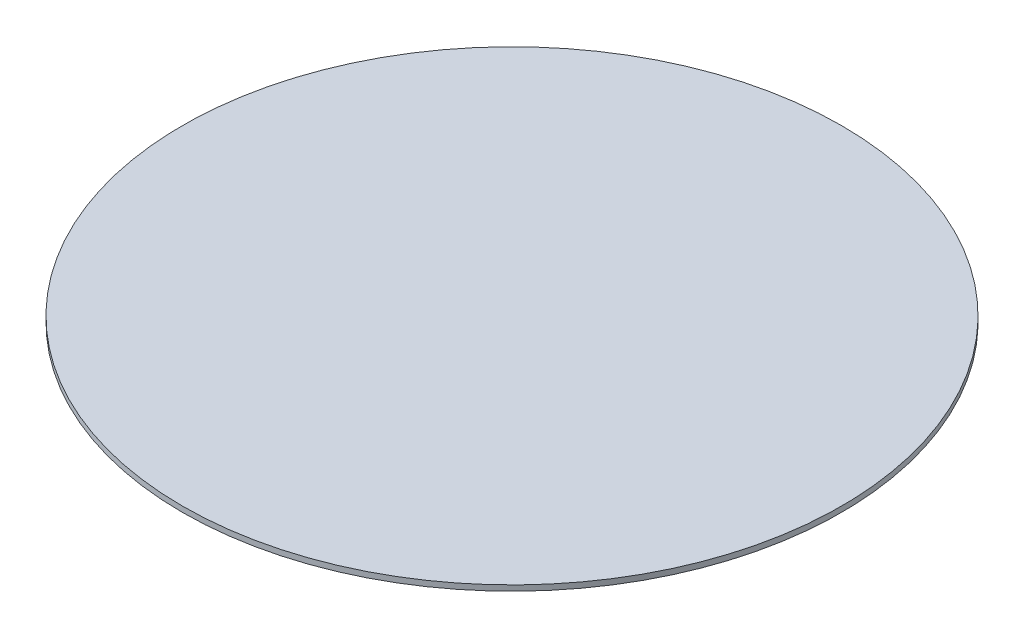
ISO-10303-21;
HEADER;
FILE_DESCRIPTION(('STEP AP214'),'2;1');
FILE_NAME('part.step','',(''),(''),'','','');
FILE_SCHEMA(('AUTOMOTIVE_DESIGN { 1 0 10303 214 1 1 1 1 }'));
ENDSEC;
DATA;
#1=APPLICATION_CONTEXT('core data for automotive mechanical design processes');
#2=APPLICATION_PROTOCOL_DEFINITION('international standard','automotive_design',2000,#1);
#3=PRODUCT_CONTEXT('',#1,'mechanical');
#4=PRODUCT('Part','Part','',(#3));
#5=PRODUCT_RELATED_PRODUCT_CATEGORY('part','',(#4));
#6=PRODUCT_DEFINITION_FORMATION('','',#4);
#7=PRODUCT_DEFINITION_CONTEXT('part definition',#1,'design');
#8=PRODUCT_DEFINITION('design','',#6,#7);
#9=PRODUCT_DEFINITION_SHAPE('','',#8);
#10=(LENGTH_UNIT() NAMED_UNIT(*) SI_UNIT(.MILLI.,.METRE.));
#11=(NAMED_UNIT(*) PLANE_ANGLE_UNIT() SI_UNIT($,.RADIAN.));
#12=(NAMED_UNIT(*) SI_UNIT($,.STERADIAN.) SOLID_ANGLE_UNIT());
#13=UNCERTAINTY_MEASURE_WITH_UNIT(LENGTH_MEASURE(1.E-05),#10,'distance_accuracy_value','');
#14=(GEOMETRIC_REPRESENTATION_CONTEXT(3) GLOBAL_UNCERTAINTY_ASSIGNED_CONTEXT((#13)) GLOBAL_UNIT_ASSIGNED_CONTEXT((#10,
#11,#12)) REPRESENTATION_CONTEXT('',''));
#15=CARTESIAN_POINT('',(0.,0.,0.));
#16=DIRECTION('',(0.,0.,1.));
#17=DIRECTION('',(1.,0.,0.));
#18=AXIS2_PLACEMENT_3D('',#15,#16,#17);
#19=CARTESIAN_POINT('',(0.,20.,0.));
#20=DIRECTION('',(0.,-1.,0.));
#21=DIRECTION('',(0.,0.,-1.));
#22=AXIS2_PLACEMENT_3D('',#19,#20,#21);
#23=CYLINDRICAL_SURFACE('',#22,1200.);
#24=CARTESIAN_POINT('',(0.,20.,0.));
#25=DIRECTION('',(0.,1.,0.));
#26=DIRECTION('',(0.,0.,1.));
#27=AXIS2_PLACEMENT_3D('',#24,#25,#26);
#28=CIRCLE('',#27,1200.);
#29=CARTESIAN_POINT('',(0.,20.,1200.));
#30=VERTEX_POINT('',#29);
#31=EDGE_CURVE('E10',#30,#30,#28,.T.);
#32=ORIENTED_EDGE('',*,*,#31,.F.);
#33=EDGE_LOOP('',(#32));
#34=FACE_BOUND('',#33,.T.);
#35=CARTESIAN_POINT('',(0.,0.,0.));
#36=DIRECTION('',(0.,1.,0.));
#37=DIRECTION('',(0.,0.,1.));
#38=AXIS2_PLACEMENT_3D('',#35,#36,#37);
#39=CIRCLE('',#38,1200.);
#40=CARTESIAN_POINT('',(0.,0.,1200.));
#41=VERTEX_POINT('',#40);
#42=EDGE_CURVE('E34',#41,#41,#39,.T.);
#43=ORIENTED_EDGE('',*,*,#42,.T.);
#44=EDGE_LOOP('',(#43));
#45=FACE_BOUND('',#44,.T.);
#46=ADVANCED_FACE('F31',(#34,#45),#23,.T.);
#47=CARTESIAN_POINT('',(0.,20.,0.));
#48=DIRECTION('',(0.,1.,0.));
#49=DIRECTION('',(0.,0.,1.));
#50=AXIS2_PLACEMENT_3D('',#47,#48,#49);
#51=PLANE('',#50);
#52=ORIENTED_EDGE('',*,*,#31,.T.);
#53=EDGE_LOOP('',(#52));
#54=FACE_BOUND('',#53,.T.);
#55=ADVANCED_FACE('F46',(#54),#51,.T.);
#56=CARTESIAN_POINT('',(0.,0.,0.));
#57=DIRECTION('',(0.,1.,0.));
#58=DIRECTION('',(0.,0.,1.));
#59=AXIS2_PLACEMENT_3D('',#56,#57,#58);
#60=PLANE('',#59);
#61=ORIENTED_EDGE('',*,*,#42,.F.);
#62=EDGE_LOOP('',(#61));
#63=FACE_BOUND('',#62,.T.);
#64=ADVANCED_FACE('F44',(#63),#60,.F.);
#65=CLOSED_SHELL('',(#46,#55,#64));
#66=MANIFOLD_SOLID_BREP('B2',#65);
#67=ADVANCED_BREP_SHAPE_REPRESENTATION('',(#18,#66),#14);
#68=SHAPE_DEFINITION_REPRESENTATION(#9,#67);
ENDSEC;
END-ISO-10303-21;
